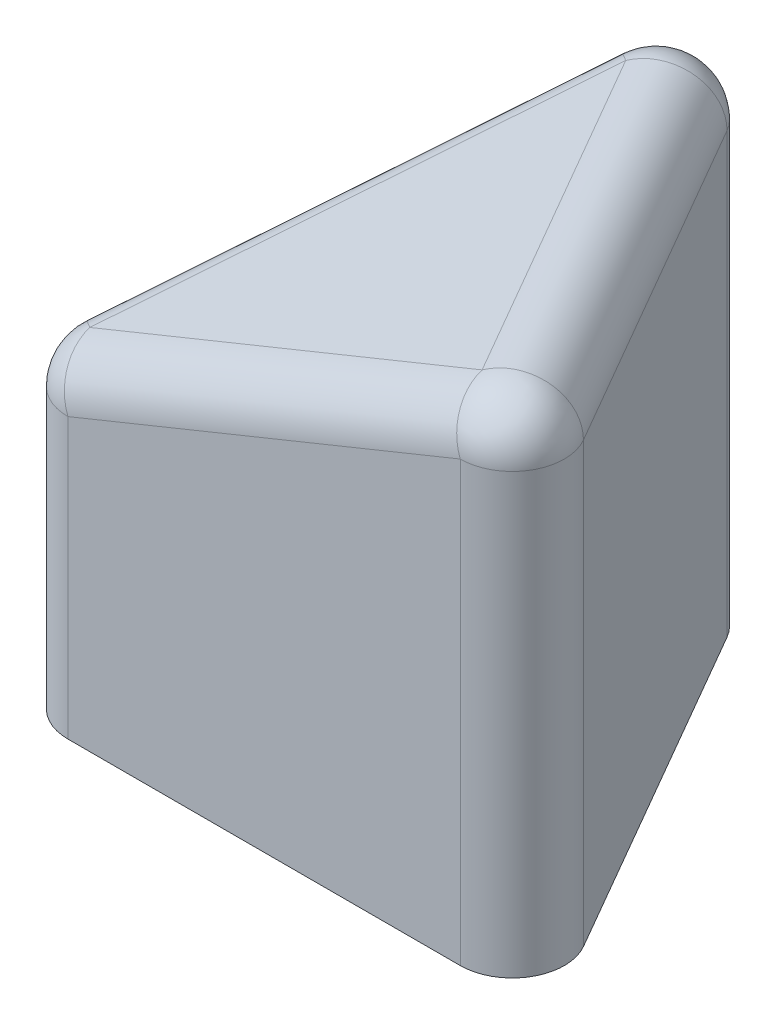
ISO-10303-21;
HEADER;
FILE_DESCRIPTION(('STEP AP214'),'2;1');
FILE_NAME('part.step','',(''),(''),'','','');
FILE_SCHEMA(('AUTOMOTIVE_DESIGN { 1 0 10303 214 1 1 1 1 }'));
ENDSEC;
DATA;
#1=APPLICATION_CONTEXT('core data for automotive mechanical design processes');
#2=APPLICATION_PROTOCOL_DEFINITION('international standard','automotive_design',2000,#1);
#3=PRODUCT_CONTEXT('',#1,'mechanical');
#4=PRODUCT('Part','Part','',(#3));
#5=PRODUCT_RELATED_PRODUCT_CATEGORY('part','',(#4));
#6=PRODUCT_DEFINITION_FORMATION('','',#4);
#7=PRODUCT_DEFINITION_CONTEXT('part definition',#1,'design');
#8=PRODUCT_DEFINITION('design','',#6,#7);
#9=PRODUCT_DEFINITION_SHAPE('','',#8);
#10=(LENGTH_UNIT() NAMED_UNIT(*) SI_UNIT(.MILLI.,.METRE.));
#11=(NAMED_UNIT(*) PLANE_ANGLE_UNIT() SI_UNIT($,.RADIAN.));
#12=(NAMED_UNIT(*) SI_UNIT($,.STERADIAN.) SOLID_ANGLE_UNIT());
#13=UNCERTAINTY_MEASURE_WITH_UNIT(LENGTH_MEASURE(1.E-05),#10,'distance_accuracy_value','');
#14=(GEOMETRIC_REPRESENTATION_CONTEXT(3) GLOBAL_UNCERTAINTY_ASSIGNED_CONTEXT((#13)) GLOBAL_UNIT_ASSIGNED_CONTEXT((#10,
#11,#12)) REPRESENTATION_CONTEXT('',''));
#15=CARTESIAN_POINT('',(0.,0.,0.));
#16=DIRECTION('',(0.,0.,1.));
#17=DIRECTION('',(1.,0.,0.));
#18=AXIS2_PLACEMENT_3D('',#15,#16,#17);
#19=CARTESIAN_POINT('',(9.26794919243112,10.,-1.));
#20=DIRECTION('',(0.,-1.,0.));
#21=DIRECTION('',(0.,0.,-1.));
#22=AXIS2_PLACEMENT_3D('',#19,#20,#21);
#23=CYLINDRICAL_SURFACE('',#22,1.);
#24=DIRECTION('',(0.,-1.,0.));
#25=VECTOR('',#24,1.);
#26=CARTESIAN_POINT('',(10.1339745962156,10.,-1.50000000000001));
#27=LINE('',#26,#25);
#28=CARTESIAN_POINT('',(10.1339745962156,8.4262852298518,-1.50000000000001));
#29=VERTEX_POINT('',#28);
#30=CARTESIAN_POINT('',(10.1339745962156,0.,-1.50000000000001));
#31=VERTEX_POINT('',#30);
#32=EDGE_CURVE('E94',#29,#31,#27,.T.);
#33=ORIENTED_EDGE('',*,*,#32,.F.);
#34=CARTESIAN_POINT('',(9.26794919243112,8.4262852298518,-1.));
#35=DIRECTION('',(0.,-1.,0.));
#36=DIRECTION('',(0.,0.,-1.));
#37=AXIS2_PLACEMENT_3D('',#34,#35,#36);
#38=CIRCLE('',#37,1.);
#39=CARTESIAN_POINT('',(9.26794919243111,8.4262852298518,0.));
#40=VERTEX_POINT('',#39);
#41=EDGE_CURVE('E151',#29,#40,#38,.T.);
#42=ORIENTED_EDGE('',*,*,#41,.T.);
#43=DIRECTION('',(0.,-1.,0.));
#44=VECTOR('',#43,1.);
#45=CARTESIAN_POINT('',(9.26794919243111,10.,0.));
#46=LINE('',#45,#44);
#47=CARTESIAN_POINT('',(9.26794919243111,0.,0.));
#48=VERTEX_POINT('',#47);
#49=EDGE_CURVE('E117',#40,#48,#46,.T.);
#50=ORIENTED_EDGE('',*,*,#49,.T.);
#51=CARTESIAN_POINT('',(9.26794919243112,0.,-1.));
#52=DIRECTION('',(0.,1.,0.));
#53=DIRECTION('',(0.,0.,1.));
#54=AXIS2_PLACEMENT_3D('',#51,#52,#53);
#55=CIRCLE('',#54,1.);
#56=EDGE_CURVE('E111',#48,#31,#55,.T.);
#57=ORIENTED_EDGE('',*,*,#56,.T.);
#58=EDGE_LOOP('',(#33,#42,#50,#57));
#59=FACE_BOUND('',#58,.T.);
#60=ADVANCED_FACE('F32',(#59),#23,.T.);
#61=CARTESIAN_POINT('',(10.1339745962156,10.,-1.50000000000001));
#62=DIRECTION('',(-0.866025403784439,0.,0.5));
#63=DIRECTION('',(0.5,0.,0.866025403784439));
#64=AXIS2_PLACEMENT_3D('',#61,#62,#63);
#65=PLANE('',#64);
#66=DIRECTION('',(0.,-1.,0.));
#67=VECTOR('',#66,1.);
#68=CARTESIAN_POINT('',(6.36602540378444,10.,-8.02627944162881));
#69=LINE('',#68,#67);
#70=CARTESIAN_POINT('',(6.36602540378444,8.4262852298518,-8.02627944162881));
#71=VERTEX_POINT('',#70);
#72=CARTESIAN_POINT('',(6.36602540378444,0.,-8.02627944162881));
#73=VERTEX_POINT('',#72);
#74=EDGE_CURVE('E105',#71,#73,#69,.T.);
#75=ORIENTED_EDGE('',*,*,#74,.F.);
#76=DIRECTION('',(-0.5,0.,-0.866025403784439));
#77=VECTOR('',#76,1.);
#78=CARTESIAN_POINT('',(10.1339745962156,8.4262852298518,-1.50000000000001));
#79=LINE('',#78,#77);
#80=EDGE_CURVE('E100',#71,#29,#79,.F.);
#81=ORIENTED_EDGE('',*,*,#80,.T.);
#82=ORIENTED_EDGE('',*,*,#32,.T.);
#83=DIRECTION('',(-0.5,0.,-0.866025403784438));
#84=VECTOR('',#83,1.);
#85=CARTESIAN_POINT('',(10.1339745962156,0.,-1.50000000000001));
#86=LINE('',#85,#84);
#87=EDGE_CURVE('E97',#31,#73,#86,.T.);
#88=ORIENTED_EDGE('',*,*,#87,.T.);
#89=EDGE_LOOP('',(#75,#81,#82,#88));
#90=FACE_BOUND('',#89,.T.);
#91=ADVANCED_FACE('F96',(#90),#65,.F.);
#92=CARTESIAN_POINT('',(5.5,10.,-7.52627944162882));
#93=DIRECTION('',(0.,-1.,0.));
#94=DIRECTION('',(0.,0.,-1.));
#95=AXIS2_PLACEMENT_3D('',#92,#93,#94);
#96=CYLINDRICAL_SURFACE('',#95,1.);
#97=DIRECTION('',(0.,-1.,0.));
#98=VECTOR('',#97,1.);
#99=CARTESIAN_POINT('',(4.63397459621556,10.,-8.02627944162881));
#100=LINE('',#99,#98);
#101=CARTESIAN_POINT('',(4.63397459621556,8.42628522985179,-8.02627944162881));
#102=VERTEX_POINT('',#101);
#103=CARTESIAN_POINT('',(4.63397459621556,0.,-8.02627944162881));
#104=VERTEX_POINT('',#103);
#105=EDGE_CURVE('E137',#102,#104,#100,.T.);
#106=ORIENTED_EDGE('',*,*,#105,.F.);
#107=CARTESIAN_POINT('',(5.5,8.4262852298518,-7.52627944162882));
#108=DIRECTION('',(0.,-1.,0.));
#109=DIRECTION('',(0.,0.,-1.));
#110=AXIS2_PLACEMENT_3D('',#107,#108,#109);
#111=CIRCLE('',#110,1.);
#112=EDGE_CURVE('E41',#102,#71,#111,.T.);
#113=ORIENTED_EDGE('',*,*,#112,.T.);
#114=ORIENTED_EDGE('',*,*,#74,.T.);
#115=CARTESIAN_POINT('',(5.5,0.,-7.52627944162882));
#116=DIRECTION('',(0.,1.,0.));
#117=DIRECTION('',(0.,0.,1.));
#118=AXIS2_PLACEMENT_3D('',#115,#116,#117);
#119=CIRCLE('',#118,1.);
#120=EDGE_CURVE('E114',#73,#104,#119,.T.);
#121=ORIENTED_EDGE('',*,*,#120,.T.);
#122=EDGE_LOOP('',(#106,#113,#114,#121));
#123=FACE_BOUND('',#122,.T.);
#124=ADVANCED_FACE('F186',(#123),#96,.T.);
#125=CARTESIAN_POINT('',(4.63397459621556,10.,-8.02627944162881));
#126=DIRECTION('',(0.866025403784439,0.,0.5));
#127=DIRECTION('',(0.5,0.,-0.866025403784439));
#128=AXIS2_PLACEMENT_3D('',#125,#126,#127);
#129=PLANE('',#128);
#130=DIRECTION('',(0.,-1.,0.));
#131=VECTOR('',#130,1.);
#132=CARTESIAN_POINT('',(0.866025403784446,10.,-1.50000000000001));
#133=LINE('',#132,#131);
#134=CARTESIAN_POINT('',(0.866025403784446,5.36456083467666,-1.50000000000001));
#135=VERTEX_POINT('',#134);
#136=CARTESIAN_POINT('',(0.866025403784446,0.,-1.50000000000001));
#137=VERTEX_POINT('',#136);
#138=EDGE_CURVE('E135',#135,#137,#133,.T.);
#139=ORIENTED_EDGE('',*,*,#138,.F.);
#140=DIRECTION('',(0.463227593724074,0.37640508186051,-0.80233372779797));
#141=VECTOR('',#140,1.);
#142=CARTESIAN_POINT('',(4.908369423999,8.64925037487606,-8.50154522468386));
#143=LINE('',#142,#141);
#144=EDGE_CURVE('E11',#135,#102,#143,.T.);
#145=ORIENTED_EDGE('',*,*,#144,.T.);
#146=ORIENTED_EDGE('',*,*,#105,.T.);
#147=DIRECTION('',(-0.5,0.,0.866025403784438));
#148=VECTOR('',#147,1.);
#149=CARTESIAN_POINT('',(4.63397459621556,0.,-8.02627944162881));
#150=LINE('',#149,#148);
#151=EDGE_CURVE('E124',#104,#137,#150,.T.);
#152=ORIENTED_EDGE('',*,*,#151,.T.);
#153=EDGE_LOOP('',(#139,#145,#146,#152));
#154=FACE_BOUND('',#153,.T.);
#155=ADVANCED_FACE('F185',(#154),#129,.F.);
#156=CARTESIAN_POINT('',(1.73205080756888,10.,-1.));
#157=DIRECTION('',(0.,-1.,0.));
#158=DIRECTION('',(0.,0.,-1.));
#159=AXIS2_PLACEMENT_3D('',#156,#157,#158);
#160=CYLINDRICAL_SURFACE('',#159,1.);
#161=DIRECTION('',(0.,-1.,0.));
#162=VECTOR('',#161,1.);
#163=CARTESIAN_POINT('',(1.73205080756889,10.,0.));
#164=LINE('',#163,#162);
#165=CARTESIAN_POINT('',(1.73205080756889,5.36456083467666,0.));
#166=VERTEX_POINT('',#165);
#167=CARTESIAN_POINT('',(1.73205080756889,0.,0.));
#168=VERTEX_POINT('',#167);
#169=EDGE_CURVE('E133',#166,#168,#164,.T.);
#170=ORIENTED_EDGE('',*,*,#169,.F.);
#171=CARTESIAN_POINT('',(1.73205080756888,5.36456083467665,-1.));
#172=DIRECTION('',(0.,-1.,0.));
#173=DIRECTION('',(0.,0.,-1.));
#174=AXIS2_PLACEMENT_3D('',#171,#172,#173);
#175=CIRCLE('',#174,1.);
#176=EDGE_CURVE('E104',#166,#135,#175,.T.);
#177=ORIENTED_EDGE('',*,*,#176,.T.);
#178=ORIENTED_EDGE('',*,*,#138,.T.);
#179=CARTESIAN_POINT('',(1.73205080756888,0.,-1.));
#180=DIRECTION('',(0.,1.,0.));
#181=DIRECTION('',(0.,0.,1.));
#182=AXIS2_PLACEMENT_3D('',#179,#180,#181);
#183=CIRCLE('',#182,1.);
#184=EDGE_CURVE('E127',#137,#168,#183,.T.);
#185=ORIENTED_EDGE('',*,*,#184,.T.);
#186=EDGE_LOOP('',(#170,#177,#178,#185));
#187=FACE_BOUND('',#186,.T.);
#188=ADVANCED_FACE('F182',(#187),#160,.T.);
#189=CARTESIAN_POINT('',(1.73205080756889,10.,0.));
#190=DIRECTION('',(0.,0.,-1.));
#191=DIRECTION('',(-1.,0.,0.));
#192=AXIS2_PLACEMENT_3D('',#189,#190,#191);
#193=PLANE('',#192);
#194=ORIENTED_EDGE('',*,*,#49,.F.);
#195=DIRECTION('',(-0.926455187448148,-0.37640508186051,0.));
#196=VECTOR('',#195,1.);
#197=CARTESIAN_POINT('',(3.34853246688477,6.02131349745438,0.));
#198=LINE('',#197,#196);
#199=EDGE_CURVE('E142',#40,#166,#198,.T.);
#200=ORIENTED_EDGE('',*,*,#199,.T.);
#201=ORIENTED_EDGE('',*,*,#169,.T.);
#202=DIRECTION('',(1.,0.,0.));
#203=VECTOR('',#202,1.);
#204=CARTESIAN_POINT('',(1.73205080756889,0.,0.));
#205=LINE('',#204,#203);
#206=EDGE_CURVE('E130',#168,#48,#205,.T.);
#207=ORIENTED_EDGE('',*,*,#206,.T.);
#208=EDGE_LOOP('',(#194,#200,#201,#207));
#209=FACE_BOUND('',#208,.T.);
#210=ADVANCED_FACE('F178',(#209),#193,.F.);
#211=CARTESIAN_POINT('',(9.26794919243112,0.,-1.));
#212=DIRECTION('',(0.,1.,0.));
#213=DIRECTION('',(0.,0.,1.));
#214=AXIS2_PLACEMENT_3D('',#211,#212,#213);
#215=PLANE('',#214);
#216=ORIENTED_EDGE('',*,*,#56,.F.);
#217=ORIENTED_EDGE('',*,*,#206,.F.);
#218=ORIENTED_EDGE('',*,*,#184,.F.);
#219=ORIENTED_EDGE('',*,*,#151,.F.);
#220=ORIENTED_EDGE('',*,*,#120,.F.);
#221=ORIENTED_EDGE('',*,*,#87,.F.);
#222=EDGE_LOOP('',(#216,#217,#218,#219,#220,#221));
#223=FACE_BOUND('',#222,.T.);
#224=ADVANCED_FACE('F109',(#223),#215,.F.);
#225=CARTESIAN_POINT('',(16.75,10.,9.95929214352105));
#226=DIRECTION('',(0.367819777735899,-0.905323964929177,-0.212360847689089));
#227=DIRECTION('',(0.926455187448148,0.37640508186051,0.));
#228=AXIS2_PLACEMENT_3D('',#225,#226,#227);
#229=PLANE('',#228);
#230=DIRECTION('',(0.463227593724074,0.37640508186051,-0.80233372779797));
#231=VECTOR('',#230,1.);
#232=CARTESIAN_POINT('',(1.32185571351418,6.23545186723319,-0.714242951459956));
#233=LINE('',#232,#231);
#234=CARTESIAN_POINT('',(5.1321802222641,9.33160919478097,-7.31391859393974));
#235=VERTEX_POINT('',#234);
#236=CARTESIAN_POINT('',(1.36423102983298,6.26988479960583,-0.787639152310912));
#237=VERTEX_POINT('',#236);
#238=EDGE_CURVE('E144',#235,#237,#233,.F.);
#239=ORIENTED_EDGE('',*,*,#238,.T.);
#240=DIRECTION('',(-0.926455187448148,-0.37640508186051,0.));
#241=VECTOR('',#240,1.);
#242=CARTESIAN_POINT('',(15.8709070411383,12.1637333586489,-0.787639152310914));
#243=LINE('',#242,#241);
#244=CARTESIAN_POINT('',(8.90012941469522,9.33160919478097,-0.787639152310911));
#245=VERTEX_POINT('',#244);
#246=EDGE_CURVE('E148',#237,#245,#243,.F.);
#247=ORIENTED_EDGE('',*,*,#246,.T.);
#248=DIRECTION('',(-0.5,0.,-0.866025403784439));
#249=VECTOR('',#248,1.);
#250=CARTESIAN_POINT('',(15.5161548184797,9.33160919478097,10.6716529912101));
#251=LINE('',#250,#249);
#252=EDGE_CURVE('E146',#245,#235,#251,.T.);
#253=ORIENTED_EDGE('',*,*,#252,.T.);
#254=EDGE_LOOP('',(#239,#247,#253));
#255=FACE_BOUND('',#254,.T.);
#256=ADVANCED_FACE('F217',(#255),#229,.F.);
#257=CARTESIAN_POINT('',(15.8839745962156,8.4262852298518,10.459292143521));
#258=DIRECTION('',(-0.5,0.,-0.866025403784439));
#259=DIRECTION('',(-0.866025403784439,0.,0.5));
#260=AXIS2_PLACEMENT_3D('',#257,#258,#259);
#261=CYLINDRICAL_SURFACE('',#260,1.);
#262=CARTESIAN_POINT('',(9.26794919243111,8.4262852298518,-1.00000000000001));
#263=DIRECTION('',(0.5,0.,0.866025403784439));
#264=DIRECTION('',(0.866025403784439,0.,-0.5));
#265=AXIS2_PLACEMENT_3D('',#262,#263,#264);
#266=CIRCLE('',#265,1.);
#267=EDGE_CURVE('E36',#29,#245,#266,.T.);
#268=ORIENTED_EDGE('',*,*,#267,.F.);
#269=ORIENTED_EDGE('',*,*,#80,.F.);
#270=CARTESIAN_POINT('',(5.50000000000001,8.4262852298518,-7.52627944162881));
#271=DIRECTION('',(-0.5,0.,-0.866025403784438));
#272=DIRECTION('',(-0.866025403784438,0.,0.5));
#273=AXIS2_PLACEMENT_3D('',#270,#271,#272);
#274=CIRCLE('',#273,1.);
#275=EDGE_CURVE('E121',#235,#71,#274,.T.);
#276=ORIENTED_EDGE('',*,*,#275,.F.);
#277=ORIENTED_EDGE('',*,*,#252,.F.);
#278=EDGE_LOOP('',(#268,#269,#276,#277));
#279=FACE_BOUND('',#278,.T.);
#280=ADVANCED_FACE('F34',(#279),#261,.T.);
#281=CARTESIAN_POINT('',(9.26794919243112,8.4262852298518,-1.));
#282=DIRECTION('',(0.,0.,1.));
#283=DIRECTION('',(1.,0.,0.));
#284=AXIS2_PLACEMENT_3D('',#281,#282,#283);
#285=SPHERICAL_SURFACE('',#284,1.);
#286=ORIENTED_EDGE('',*,*,#41,.F.);
#287=ORIENTED_EDGE('',*,*,#267,.T.);
#288=CARTESIAN_POINT('',(9.26794919243112,8.4262852298518,-1.));
#289=DIRECTION('',(-0.926455187448149,-0.376405081860507,0.));
#290=DIRECTION('',(0.376405081860507,-0.926455187448149,0.));
#291=AXIS2_PLACEMENT_3D('',#288,#289,#290);
#292=CIRCLE('',#291,1.);
#293=EDGE_CURVE('E163',#40,#245,#292,.T.);
#294=ORIENTED_EDGE('',*,*,#293,.F.);
#295=EDGE_LOOP('',(#286,#287,#294));
#296=FACE_BOUND('',#295,.T.);
#297=ADVANCED_FACE('F175',(#296),#285,.T.);
#298=CARTESIAN_POINT('',(5.5,8.4262852298518,-7.52627944162882));
#299=DIRECTION('',(0.,0.,1.));
#300=DIRECTION('',(1.,0.,0.));
#301=AXIS2_PLACEMENT_3D('',#298,#299,#300);
#302=SPHERICAL_SURFACE('',#301,1.);
#303=ORIENTED_EDGE('',*,*,#275,.T.);
#304=ORIENTED_EDGE('',*,*,#112,.F.);
#305=CARTESIAN_POINT('',(5.5,8.4262852298518,-7.52627944162882));
#306=DIRECTION('',(-0.463227593724065,-0.376405081860507,0.802333727797977));
#307=DIRECTION('',(0.866025403784445,0.,0.49999999999999));
#308=AXIS2_PLACEMENT_3D('',#305,#306,#307);
#309=CIRCLE('',#308,1.);
#310=EDGE_CURVE('E160',#235,#102,#309,.T.);
#311=ORIENTED_EDGE('',*,*,#310,.F.);
#312=EDGE_LOOP('',(#303,#304,#311));
#313=FACE_BOUND('',#312,.T.);
#314=ADVANCED_FACE('F168',(#313),#302,.T.);
#315=CARTESIAN_POINT('',(3.34853246688477,6.02131349745438,-1.));
#316=DIRECTION('',(-0.926455187448148,-0.37640508186051,0.));
#317=DIRECTION('',(0.37640508186051,-0.926455187448148,0.));
#318=AXIS2_PLACEMENT_3D('',#315,#316,#317);
#319=CYLINDRICAL_SURFACE('',#318,1.);
#320=ORIENTED_EDGE('',*,*,#293,.T.);
#321=ORIENTED_EDGE('',*,*,#246,.F.);
#322=CARTESIAN_POINT('',(1.73205080756889,5.36456083467666,-1.));
#323=DIRECTION('',(-0.926455187448143,-0.376405081860522,0.));
#324=DIRECTION('',(0.376405081860522,-0.926455187448143,0.));
#325=AXIS2_PLACEMENT_3D('',#322,#323,#324);
#326=CIRCLE('',#325,1.);
#327=EDGE_CURVE('E157',#166,#237,#326,.T.);
#328=ORIENTED_EDGE('',*,*,#327,.F.);
#329=ORIENTED_EDGE('',*,*,#199,.F.);
#330=EDGE_LOOP('',(#320,#321,#328,#329));
#331=FACE_BOUND('',#330,.T.);
#332=ADVANCED_FACE('F207',(#331),#319,.T.);
#333=CARTESIAN_POINT('',(5.77439482778344,8.64925037487606,-8.00154522468386));
#334=DIRECTION('',(0.463227593724074,0.37640508186051,-0.80233372779797));
#335=DIRECTION('',(-0.866025403784439,0.,-0.5));
#336=AXIS2_PLACEMENT_3D('',#333,#334,#335);
#337=CYLINDRICAL_SURFACE('',#336,1.);
#338=ORIENTED_EDGE('',*,*,#310,.T.);
#339=ORIENTED_EDGE('',*,*,#144,.F.);
#340=CARTESIAN_POINT('',(1.73205080756888,5.36456083467665,-1.));
#341=DIRECTION('',(-0.463227593724084,-0.376405081860512,0.802333727797963));
#342=DIRECTION('',(0.866025403784432,0.,0.500000000000012));
#343=AXIS2_PLACEMENT_3D('',#340,#341,#342);
#344=CIRCLE('',#343,1.);
#345=EDGE_CURVE('E155',#237,#135,#344,.T.);
#346=ORIENTED_EDGE('',*,*,#345,.F.);
#347=ORIENTED_EDGE('',*,*,#238,.F.);
#348=EDGE_LOOP('',(#338,#339,#346,#347));
#349=FACE_BOUND('',#348,.T.);
#350=ADVANCED_FACE('F203',(#349),#337,.T.);
#351=CARTESIAN_POINT('',(1.73205080756888,5.36456083467665,-1.));
#352=DIRECTION('',(0.,0.,1.));
#353=DIRECTION('',(1.,0.,0.));
#354=AXIS2_PLACEMENT_3D('',#351,#352,#353);
#355=SPHERICAL_SURFACE('',#354,1.);
#356=ORIENTED_EDGE('',*,*,#176,.F.);
#357=ORIENTED_EDGE('',*,*,#327,.T.);
#358=ORIENTED_EDGE('',*,*,#345,.T.);
#359=EDGE_LOOP('',(#356,#357,#358));
#360=FACE_BOUND('',#359,.T.);
#361=ADVANCED_FACE('F200',(#360),#355,.T.);
#362=CLOSED_SHELL('',(#60,#91,#124,#155,#188,#210,#224,#256,#280,#297,#314,#332,#350,#361));
#363=MANIFOLD_SOLID_BREP('B2',#362);
#364=ADVANCED_BREP_SHAPE_REPRESENTATION('',(#18,#363),#14);
#365=SHAPE_DEFINITION_REPRESENTATION(#9,#364);
ENDSEC;
END-ISO-10303-21;
